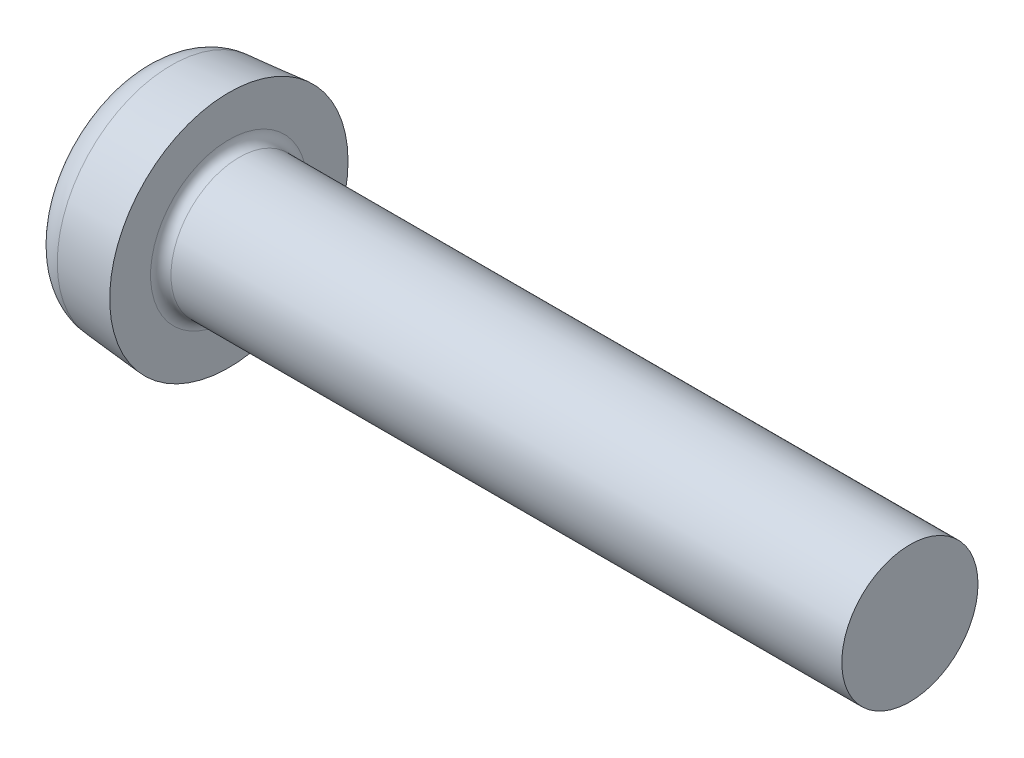
ISO-10303-21;
HEADER;
FILE_DESCRIPTION(('STEP AP214'),'2;1');
FILE_NAME('part.step','',(''),(''),'','','');
FILE_SCHEMA(('AUTOMOTIVE_DESIGN { 1 0 10303 214 1 1 1 1 }'));
ENDSEC;
DATA;
#1=APPLICATION_CONTEXT('core data for automotive mechanical design processes');
#2=APPLICATION_PROTOCOL_DEFINITION('international standard','automotive_design',2000,#1);
#3=PRODUCT_CONTEXT('',#1,'mechanical');
#4=PRODUCT('Part','Part','',(#3));
#5=PRODUCT_RELATED_PRODUCT_CATEGORY('part','',(#4));
#6=PRODUCT_DEFINITION_FORMATION('','',#4);
#7=PRODUCT_DEFINITION_CONTEXT('part definition',#1,'design');
#8=PRODUCT_DEFINITION('design','',#6,#7);
#9=PRODUCT_DEFINITION_SHAPE('','',#8);
#10=(LENGTH_UNIT() NAMED_UNIT(*) SI_UNIT(.MILLI.,.METRE.));
#11=(NAMED_UNIT(*) PLANE_ANGLE_UNIT() SI_UNIT($,.RADIAN.));
#12=(NAMED_UNIT(*) SI_UNIT($,.STERADIAN.) SOLID_ANGLE_UNIT());
#13=UNCERTAINTY_MEASURE_WITH_UNIT(LENGTH_MEASURE(1.E-05),#10,'distance_accuracy_value','');
#14=(GEOMETRIC_REPRESENTATION_CONTEXT(3) GLOBAL_UNCERTAINTY_ASSIGNED_CONTEXT((#13)) GLOBAL_UNIT_ASSIGNED_CONTEXT((#10,
#11,#12)) REPRESENTATION_CONTEXT('',''));
#15=CARTESIAN_POINT('',(0.,0.,0.));
#16=DIRECTION('',(0.,0.,1.));
#17=DIRECTION('',(1.,0.,0.));
#18=AXIS2_PLACEMENT_3D('',#15,#16,#17);
#19=CARTESIAN_POINT('',(0.,0.,0.));
#20=DIRECTION('',(-1.,0.,0.));
#21=DIRECTION('',(0.,0.,1.));
#22=AXIS2_PLACEMENT_3D('',#19,#20,#21);
#23=PLANE('',#22);
#24=CARTESIAN_POINT('',(0.,0.,0.));
#25=DIRECTION('',(-1.,0.,0.));
#26=DIRECTION('',(0.,0.,1.));
#27=AXIS2_PLACEMENT_3D('',#24,#25,#26);
#28=CIRCLE('',#27,2.35619830081517);
#29=CARTESIAN_POINT('',(0.,0.,2.35619830081517));
#30=VERTEX_POINT('',#29);
#31=EDGE_CURVE('E11',#30,#30,#28,.T.);
#32=ORIENTED_EDGE('',*,*,#31,.T.);
#33=EDGE_LOOP('',(#32));
#34=FACE_BOUND('',#33,.T.);
#35=DIRECTION('',(0.,0.,-1.));
#36=VECTOR('',#35,1.);
#37=CARTESIAN_POINT('',(0.,-0.41,0.41));
#38=LINE('',#37,#36);
#39=CARTESIAN_POINT('',(0.,-0.41,2.05));
#40=VERTEX_POINT('',#39);
#41=CARTESIAN_POINT('',(0.,-0.41,0.71));
#42=VERTEX_POINT('',#41);
#43=EDGE_CURVE('E230',#40,#42,#38,.T.);
#44=ORIENTED_EDGE('',*,*,#43,.T.);
#45=CARTESIAN_POINT('',(0.,-0.71,0.71));
#46=DIRECTION('',(-1.,0.,0.));
#47=DIRECTION('',(0.,0.,1.));
#48=AXIS2_PLACEMENT_3D('',#45,#46,#47);
#49=CIRCLE('',#48,0.3);
#50=CARTESIAN_POINT('',(0.,-0.71,0.409999999999999));
#51=VERTEX_POINT('',#50);
#52=EDGE_CURVE('E178',#42,#51,#49,.T.);
#53=ORIENTED_EDGE('',*,*,#52,.T.);
#54=DIRECTION('',(0.,-1.,0.));
#55=VECTOR('',#54,1.);
#56=CARTESIAN_POINT('',(0.,-0.41,0.41));
#57=LINE('',#56,#55);
#58=CARTESIAN_POINT('',(0.,-2.05,0.409999999999999));
#59=VERTEX_POINT('',#58);
#60=EDGE_CURVE('E227',#51,#59,#57,.T.);
#61=ORIENTED_EDGE('',*,*,#60,.T.);
#62=DIRECTION('',(0.,0.,-1.));
#63=VECTOR('',#62,1.);
#64=CARTESIAN_POINT('',(0.,-2.05,-0.41));
#65=LINE('',#64,#63);
#66=CARTESIAN_POINT('',(0.,-2.05,-0.41));
#67=VERTEX_POINT('',#66);
#68=EDGE_CURVE('E109',#59,#67,#65,.T.);
#69=ORIENTED_EDGE('',*,*,#68,.T.);
#70=DIRECTION('',(0.,1.,0.));
#71=VECTOR('',#70,1.);
#72=CARTESIAN_POINT('',(0.,-0.41,-0.41));
#73=LINE('',#72,#71);
#74=CARTESIAN_POINT('',(0.,-0.71,-0.41));
#75=VERTEX_POINT('',#74);
#76=EDGE_CURVE('E223',#67,#75,#73,.T.);
#77=ORIENTED_EDGE('',*,*,#76,.T.);
#78=CARTESIAN_POINT('',(0.,-0.71,-0.71));
#79=DIRECTION('',(-1.,0.,0.));
#80=DIRECTION('',(0.,0.,1.));
#81=AXIS2_PLACEMENT_3D('',#78,#79,#80);
#82=CIRCLE('',#81,0.3);
#83=CARTESIAN_POINT('',(0.,-0.41,-0.71));
#84=VERTEX_POINT('',#83);
#85=EDGE_CURVE('E181',#75,#84,#82,.T.);
#86=ORIENTED_EDGE('',*,*,#85,.T.);
#87=DIRECTION('',(0.,0.,-1.));
#88=VECTOR('',#87,1.);
#89=CARTESIAN_POINT('',(0.,-0.41,-0.41));
#90=LINE('',#89,#88);
#91=CARTESIAN_POINT('',(0.,-0.41,-2.05));
#92=VERTEX_POINT('',#91);
#93=EDGE_CURVE('E220',#84,#92,#90,.T.);
#94=ORIENTED_EDGE('',*,*,#93,.T.);
#95=DIRECTION('',(0.,1.,0.));
#96=VECTOR('',#95,1.);
#97=CARTESIAN_POINT('',(0.,0.41,-2.05));
#98=LINE('',#97,#96);
#99=CARTESIAN_POINT('',(0.,0.41,-2.05));
#100=VERTEX_POINT('',#99);
#101=EDGE_CURVE('E217',#92,#100,#98,.T.);
#102=ORIENTED_EDGE('',*,*,#101,.T.);
#103=DIRECTION('',(0.,0.,1.));
#104=VECTOR('',#103,1.);
#105=CARTESIAN_POINT('',(0.,0.41,-0.41));
#106=LINE('',#105,#104);
#107=CARTESIAN_POINT('',(0.,0.41,-0.71));
#108=VERTEX_POINT('',#107);
#109=EDGE_CURVE('E214',#100,#108,#106,.T.);
#110=ORIENTED_EDGE('',*,*,#109,.T.);
#111=CARTESIAN_POINT('',(0.,0.71,-0.71));
#112=DIRECTION('',(-1.,0.,0.));
#113=DIRECTION('',(0.,0.,1.));
#114=AXIS2_PLACEMENT_3D('',#111,#112,#113);
#115=CIRCLE('',#114,0.3);
#116=CARTESIAN_POINT('',(0.,0.71,-0.41));
#117=VERTEX_POINT('',#116);
#118=EDGE_CURVE('E187',#108,#117,#115,.T.);
#119=ORIENTED_EDGE('',*,*,#118,.T.);
#120=DIRECTION('',(0.,1.,0.));
#121=VECTOR('',#120,1.);
#122=CARTESIAN_POINT('',(0.,0.41,-0.41));
#123=LINE('',#122,#121);
#124=CARTESIAN_POINT('',(0.,2.05,-0.41));
#125=VERTEX_POINT('',#124);
#126=EDGE_CURVE('E211',#117,#125,#123,.T.);
#127=ORIENTED_EDGE('',*,*,#126,.T.);
#128=DIRECTION('',(0.,0.,1.));
#129=VECTOR('',#128,1.);
#130=CARTESIAN_POINT('',(0.,2.05,-0.41));
#131=LINE('',#130,#129);
#132=CARTESIAN_POINT('',(0.,2.05,0.41));
#133=VERTEX_POINT('',#132);
#134=EDGE_CURVE('E208',#125,#133,#131,.T.);
#135=ORIENTED_EDGE('',*,*,#134,.T.);
#136=DIRECTION('',(0.,-1.,0.));
#137=VECTOR('',#136,1.);
#138=CARTESIAN_POINT('',(0.,0.41,0.41));
#139=LINE('',#138,#137);
#140=CARTESIAN_POINT('',(0.,0.71,0.41));
#141=VERTEX_POINT('',#140);
#142=EDGE_CURVE('E205',#133,#141,#139,.T.);
#143=ORIENTED_EDGE('',*,*,#142,.T.);
#144=CARTESIAN_POINT('',(0.,0.71,0.71));
#145=DIRECTION('',(-1.,0.,0.));
#146=DIRECTION('',(0.,0.,1.));
#147=AXIS2_PLACEMENT_3D('',#144,#145,#146);
#148=CIRCLE('',#147,0.3);
#149=CARTESIAN_POINT('',(0.,0.41,0.71));
#150=VERTEX_POINT('',#149);
#151=EDGE_CURVE('E184',#141,#150,#148,.T.);
#152=ORIENTED_EDGE('',*,*,#151,.T.);
#153=DIRECTION('',(0.,0.,1.));
#154=VECTOR('',#153,1.);
#155=CARTESIAN_POINT('',(0.,0.41,0.41));
#156=LINE('',#155,#154);
#157=CARTESIAN_POINT('',(0.,0.409999999999999,2.05));
#158=VERTEX_POINT('',#157);
#159=EDGE_CURVE('E236',#150,#158,#156,.T.);
#160=ORIENTED_EDGE('',*,*,#159,.T.);
#161=DIRECTION('',(0.,-1.,0.));
#162=VECTOR('',#161,1.);
#163=CARTESIAN_POINT('',(0.,0.409999999999999,2.05));
#164=LINE('',#163,#162);
#165=EDGE_CURVE('E233',#158,#40,#164,.T.);
#166=ORIENTED_EDGE('',*,*,#165,.T.);
#167=EDGE_LOOP('',(#44,#53,#61,#69,#77,#86,#94,#102,#110,#119,#127,#135,#143,#152,#160,#166));
#168=FACE_BOUND('',#167,.T.);
#169=ADVANCED_FACE('F37',(#34,#168),#23,.T.);
#170=CARTESIAN_POINT('',(22.6,2.,0.));
#171=DIRECTION('',(1.,0.,0.));
#172=DIRECTION('',(0.,0.,-1.));
#173=AXIS2_PLACEMENT_3D('',#170,#171,#172);
#174=PLANE('',#173);
#175=CARTESIAN_POINT('',(22.6,0.,0.));
#176=DIRECTION('',(1.,0.,0.));
#177=DIRECTION('',(0.,0.,-1.));
#178=AXIS2_PLACEMENT_3D('',#175,#176,#177);
#179=CIRCLE('',#178,2.);
#180=CARTESIAN_POINT('',(22.6,0.,-2.));
#181=VERTEX_POINT('',#180);
#182=EDGE_CURVE('E193',#181,#181,#179,.T.);
#183=ORIENTED_EDGE('',*,*,#182,.T.);
#184=EDGE_LOOP('',(#183));
#185=FACE_BOUND('',#184,.T.);
#186=ADVANCED_FACE('F355',(#185),#174,.T.);
#187=CARTESIAN_POINT('',(4.51581291088132,0.,0.));
#188=DIRECTION('',(1.,0.,0.));
#189=DIRECTION('',(0.,0.,-1.));
#190=AXIS2_PLACEMENT_3D('',#187,#188,#189);
#191=CYLINDRICAL_SURFACE('',#190,2.);
#192=CARTESIAN_POINT('',(2.9,0.,0.));
#193=DIRECTION('',(1.,0.,0.));
#194=DIRECTION('',(0.,0.,-1.));
#195=AXIS2_PLACEMENT_3D('',#192,#193,#194);
#196=CIRCLE('',#195,2.);
#197=CARTESIAN_POINT('',(2.9,0.,-2.));
#198=VERTEX_POINT('',#197);
#199=EDGE_CURVE('E196',#198,#198,#196,.T.);
#200=ORIENTED_EDGE('',*,*,#199,.T.);
#201=EDGE_LOOP('',(#200));
#202=FACE_BOUND('',#201,.T.);
#203=ORIENTED_EDGE('',*,*,#182,.F.);
#204=EDGE_LOOP('',(#203));
#205=FACE_BOUND('',#204,.T.);
#206=ADVANCED_FACE('F361',(#202,#205),#191,.T.);
#207=CARTESIAN_POINT('',(2.9,0.,0.));
#208=DIRECTION('',(1.,0.,0.));
#209=DIRECTION('',(0.,0.,-1.));
#210=AXIS2_PLACEMENT_3D('',#207,#208,#209);
#211=TOROIDAL_SURFACE('',#210,2.3,0.3);
#212=CARTESIAN_POINT('',(2.6,0.,0.));
#213=DIRECTION('',(1.,0.,0.));
#214=DIRECTION('',(0.,0.,-1.));
#215=AXIS2_PLACEMENT_3D('',#212,#213,#214);
#216=CIRCLE('',#215,2.3);
#217=CARTESIAN_POINT('',(2.6,0.,-2.3));
#218=VERTEX_POINT('',#217);
#219=EDGE_CURVE('E199',#218,#218,#216,.T.);
#220=ORIENTED_EDGE('',*,*,#219,.T.);
#221=EDGE_LOOP('',(#220));
#222=FACE_BOUND('',#221,.T.);
#223=ORIENTED_EDGE('',*,*,#199,.F.);
#224=EDGE_LOOP('',(#223));
#225=FACE_BOUND('',#224,.T.);
#226=ADVANCED_FACE('F372',(#222,#225),#211,.F.);
#227=CARTESIAN_POINT('',(2.6,2.3,0.));
#228=DIRECTION('',(1.,0.,0.));
#229=DIRECTION('',(0.,0.,-1.));
#230=AXIS2_PLACEMENT_3D('',#227,#228,#229);
#231=PLANE('',#230);
#232=CARTESIAN_POINT('',(2.6,0.,0.));
#233=DIRECTION('',(1.,0.,0.));
#234=DIRECTION('',(0.,0.,-1.));
#235=AXIS2_PLACEMENT_3D('',#232,#233,#234);
#236=CIRCLE('',#235,3.5);
#237=CARTESIAN_POINT('',(2.6,0.,-3.5));
#238=VERTEX_POINT('',#237);
#239=EDGE_CURVE('E144',#238,#238,#236,.T.);
#240=ORIENTED_EDGE('',*,*,#239,.T.);
#241=EDGE_LOOP('',(#240));
#242=FACE_BOUND('',#241,.T.);
#243=ORIENTED_EDGE('',*,*,#219,.F.);
#244=EDGE_LOOP('',(#243));
#245=FACE_BOUND('',#244,.T.);
#246=ADVANCED_FACE('F368',(#242,#245),#231,.T.);
#247=CARTESIAN_POINT('',(2.6,0.,0.));
#248=DIRECTION('',(1.,0.,0.));
#249=DIRECTION('',(0.,0.,-1.));
#250=AXIS2_PLACEMENT_3D('',#247,#248,#249);
#251=CONICAL_SURFACE('',#250,3.5,0.08726646259972);
#252=CARTESIAN_POINT('',(0.91284425725234,0.,0.));
#253=DIRECTION('',(-1.,0.,0.));
#254=DIRECTION('',(0.,0.,1.));
#255=AXIS2_PLACEMENT_3D('',#252,#253,#254);
#256=CIRCLE('',#255,3.35239299890691);
#257=CARTESIAN_POINT('',(0.91284425725234,0.,3.35239299890691));
#258=VERTEX_POINT('',#257);
#259=EDGE_CURVE('E47',#258,#258,#256,.F.);
#260=ORIENTED_EDGE('',*,*,#259,.T.);
#261=EDGE_LOOP('',(#260));
#262=FACE_BOUND('',#261,.T.);
#263=ORIENTED_EDGE('',*,*,#239,.F.);
#264=EDGE_LOOP('',(#263));
#265=FACE_BOUND('',#264,.T.);
#266=ADVANCED_FACE('F365',(#262,#265),#251,.T.);
#267=CARTESIAN_POINT('',(2.6,0.41,0.41));
#268=DIRECTION('',(0.,-1.,0.));
#269=DIRECTION('',(0.,0.,-1.));
#270=AXIS2_PLACEMENT_3D('',#267,#268,#269);
#271=PLANE('',#270);
#272=ORIENTED_EDGE('',*,*,#159,.F.);
#273=DIRECTION('',(-1.,0.,0.));
#274=VECTOR('',#273,1.);
#275=CARTESIAN_POINT('',(2.6,0.41,0.71));
#276=LINE('',#275,#274);
#277=CARTESIAN_POINT('',(2.6,0.41,0.71));
#278=VERTEX_POINT('',#277);
#279=EDGE_CURVE('E165',#150,#278,#276,.F.);
#280=ORIENTED_EDGE('',*,*,#279,.T.);
#281=DIRECTION('',(0.,0.,1.));
#282=VECTOR('',#281,1.);
#283=CARTESIAN_POINT('',(2.6,0.41,0.41));
#284=LINE('',#283,#282);
#285=CARTESIAN_POINT('',(2.6,0.41,1.10367739090787));
#286=VERTEX_POINT('',#285);
#287=EDGE_CURVE('E147',#278,#286,#284,.T.);
#288=ORIENTED_EDGE('',*,*,#287,.T.);
#289=DIRECTION('',(-0.939692620785908,0.,0.342020143325669));
#290=VECTOR('',#289,1.);
#291=CARTESIAN_POINT('',(0.,0.409999999999999,2.05));
#292=LINE('',#291,#290);
#293=EDGE_CURVE('E141',#286,#158,#292,.T.);
#294=ORIENTED_EDGE('',*,*,#293,.T.);
#295=EDGE_LOOP('',(#272,#280,#288,#294));
#296=FACE_BOUND('',#295,.T.);
#297=ADVANCED_FACE('F250',(#296),#271,.T.);
#298=CARTESIAN_POINT('',(0.,0.409999999999999,2.05));
#299=DIRECTION('',(-0.342020143325669,0.,-0.939692620785908));
#300=DIRECTION('',(-0.939692620785908,0.,0.342020143325669));
#301=AXIS2_PLACEMENT_3D('',#298,#299,#300);
#302=PLANE('',#301);
#303=ORIENTED_EDGE('',*,*,#165,.F.);
#304=ORIENTED_EDGE('',*,*,#293,.F.);
#305=DIRECTION('',(0.,-1.,0.));
#306=VECTOR('',#305,1.);
#307=CARTESIAN_POINT('',(2.6,0.41,1.10367739090787));
#308=LINE('',#307,#306);
#309=CARTESIAN_POINT('',(2.6,-0.41,1.10367739090787));
#310=VERTEX_POINT('',#309);
#311=EDGE_CURVE('E145',#286,#310,#308,.T.);
#312=ORIENTED_EDGE('',*,*,#311,.T.);
#313=DIRECTION('',(-0.939692620785908,0.,0.342020143325669));
#314=VECTOR('',#313,1.);
#315=CARTESIAN_POINT('',(2.82294361599763,-0.41,1.02253255076506));
#316=LINE('',#315,#314);
#317=EDGE_CURVE('E110',#310,#40,#316,.T.);
#318=ORIENTED_EDGE('',*,*,#317,.T.);
#319=EDGE_LOOP('',(#303,#304,#312,#318));
#320=FACE_BOUND('',#319,.T.);
#321=ADVANCED_FACE('F259',(#320),#302,.T.);
#322=CARTESIAN_POINT('',(2.6,-0.41,0.41));
#323=DIRECTION('',(0.,1.,0.));
#324=DIRECTION('',(0.,0.,1.));
#325=AXIS2_PLACEMENT_3D('',#322,#323,#324);
#326=PLANE('',#325);
#327=DIRECTION('',(0.,0.,-1.));
#328=VECTOR('',#327,1.);
#329=CARTESIAN_POINT('',(2.6,-0.41,0.41));
#330=LINE('',#329,#328);
#331=CARTESIAN_POINT('',(2.6,-0.41,0.71));
#332=VERTEX_POINT('',#331);
#333=EDGE_CURVE('E105',#310,#332,#330,.T.);
#334=ORIENTED_EDGE('',*,*,#333,.T.);
#335=DIRECTION('',(-1.,0.,0.));
#336=VECTOR('',#335,1.);
#337=CARTESIAN_POINT('',(2.6,-0.41,0.71));
#338=LINE('',#337,#336);
#339=EDGE_CURVE('E190',#332,#42,#338,.T.);
#340=ORIENTED_EDGE('',*,*,#339,.T.);
#341=ORIENTED_EDGE('',*,*,#43,.F.);
#342=ORIENTED_EDGE('',*,*,#317,.F.);
#343=EDGE_LOOP('',(#334,#340,#341,#342));
#344=FACE_BOUND('',#343,.T.);
#345=ADVANCED_FACE('F344',(#344),#326,.T.);
#346=CARTESIAN_POINT('',(2.6,-0.41,0.41));
#347=DIRECTION('',(0.,0.,-1.));
#348=DIRECTION('',(0.,1.,0.));
#349=AXIS2_PLACEMENT_3D('',#346,#347,#348);
#350=PLANE('',#349);
#351=ORIENTED_EDGE('',*,*,#60,.F.);
#352=DIRECTION('',(-1.,0.,0.));
#353=VECTOR('',#352,1.);
#354=CARTESIAN_POINT('',(2.6,-0.71,0.409999999999999));
#355=LINE('',#354,#353);
#356=CARTESIAN_POINT('',(2.6,-0.71,0.409999999999999));
#357=VERTEX_POINT('',#356);
#358=EDGE_CURVE('E101',#51,#357,#355,.F.);
#359=ORIENTED_EDGE('',*,*,#358,.T.);
#360=DIRECTION('',(0.,-1.,0.));
#361=VECTOR('',#360,1.);
#362=CARTESIAN_POINT('',(2.6,-0.41,0.41));
#363=LINE('',#362,#361);
#364=CARTESIAN_POINT('',(2.6,-1.10367739090787,0.409999999999999));
#365=VERTEX_POINT('',#364);
#366=EDGE_CURVE('E94',#357,#365,#363,.T.);
#367=ORIENTED_EDGE('',*,*,#366,.T.);
#368=DIRECTION('',(-0.939692620785908,-0.342020143325669,0.));
#369=VECTOR('',#368,1.);
#370=CARTESIAN_POINT('',(0.,-2.05,0.409999999999999));
#371=LINE('',#370,#369);
#372=EDGE_CURVE('E41',#365,#59,#371,.T.);
#373=ORIENTED_EDGE('',*,*,#372,.T.);
#374=EDGE_LOOP('',(#351,#359,#367,#373));
#375=FACE_BOUND('',#374,.T.);
#376=ADVANCED_FACE('F96',(#375),#350,.T.);
#377=CARTESIAN_POINT('',(0.,-2.05,-0.41));
#378=DIRECTION('',(-0.342020143325669,0.939692620785908,0.));
#379=DIRECTION('',(-0.939692620785908,-0.342020143325669,0.));
#380=AXIS2_PLACEMENT_3D('',#377,#378,#379);
#381=PLANE('',#380);
#382=ORIENTED_EDGE('',*,*,#68,.F.);
#383=ORIENTED_EDGE('',*,*,#372,.F.);
#384=DIRECTION('',(0.,0.,-1.));
#385=VECTOR('',#384,1.);
#386=CARTESIAN_POINT('',(2.6,-1.10367739090787,-0.41));
#387=LINE('',#386,#385);
#388=CARTESIAN_POINT('',(2.6,-1.10367739090787,-0.41));
#389=VERTEX_POINT('',#388);
#390=EDGE_CURVE('E87',#365,#389,#387,.T.);
#391=ORIENTED_EDGE('',*,*,#390,.T.);
#392=DIRECTION('',(-0.939692620785908,-0.342020143325669,0.));
#393=VECTOR('',#392,1.);
#394=CARTESIAN_POINT('',(2.82294361599763,-1.02253255076506,-0.41));
#395=LINE('',#394,#393);
#396=EDGE_CURVE('E111',#389,#67,#395,.T.);
#397=ORIENTED_EDGE('',*,*,#396,.T.);
#398=EDGE_LOOP('',(#382,#383,#391,#397));
#399=FACE_BOUND('',#398,.T.);
#400=ADVANCED_FACE('F107',(#399),#381,.T.);
#401=CARTESIAN_POINT('',(2.6,-0.41,-0.41));
#402=DIRECTION('',(0.,0.,1.));
#403=DIRECTION('',(1.,0.,0.));
#404=AXIS2_PLACEMENT_3D('',#401,#402,#403);
#405=PLANE('',#404);
#406=DIRECTION('',(0.,1.,0.));
#407=VECTOR('',#406,1.);
#408=CARTESIAN_POINT('',(2.6,-0.41,-0.41));
#409=LINE('',#408,#407);
#410=CARTESIAN_POINT('',(2.6,-0.71,-0.41));
#411=VERTEX_POINT('',#410);
#412=EDGE_CURVE('E117',#389,#411,#409,.T.);
#413=ORIENTED_EDGE('',*,*,#412,.T.);
#414=DIRECTION('',(-1.,0.,0.));
#415=VECTOR('',#414,1.);
#416=CARTESIAN_POINT('',(2.6,-0.71,-0.41));
#417=LINE('',#416,#415);
#418=EDGE_CURVE('E174',#411,#75,#417,.T.);
#419=ORIENTED_EDGE('',*,*,#418,.T.);
#420=ORIENTED_EDGE('',*,*,#76,.F.);
#421=ORIENTED_EDGE('',*,*,#396,.F.);
#422=EDGE_LOOP('',(#413,#419,#420,#421));
#423=FACE_BOUND('',#422,.T.);
#424=ADVANCED_FACE('F339',(#423),#405,.T.);
#425=CARTESIAN_POINT('',(2.6,-0.41,-0.41));
#426=DIRECTION('',(0.,1.,0.));
#427=DIRECTION('',(0.,0.,1.));
#428=AXIS2_PLACEMENT_3D('',#425,#426,#427);
#429=PLANE('',#428);
#430=ORIENTED_EDGE('',*,*,#93,.F.);
#431=DIRECTION('',(-1.,0.,0.));
#432=VECTOR('',#431,1.);
#433=CARTESIAN_POINT('',(2.6,-0.41,-0.71));
#434=LINE('',#433,#432);
#435=CARTESIAN_POINT('',(2.6,-0.41,-0.71));
#436=VERTEX_POINT('',#435);
#437=EDGE_CURVE('E171',#84,#436,#434,.F.);
#438=ORIENTED_EDGE('',*,*,#437,.T.);
#439=DIRECTION('',(0.,0.,-1.));
#440=VECTOR('',#439,1.);
#441=CARTESIAN_POINT('',(2.6,-0.41,-0.41));
#442=LINE('',#441,#440);
#443=CARTESIAN_POINT('',(2.6,-0.41,-1.10367739090787));
#444=VERTEX_POINT('',#443);
#445=EDGE_CURVE('E118',#436,#444,#442,.T.);
#446=ORIENTED_EDGE('',*,*,#445,.T.);
#447=DIRECTION('',(-0.939692620785908,0.,-0.342020143325669));
#448=VECTOR('',#447,1.);
#449=CARTESIAN_POINT('',(0.,-0.41,-2.05));
#450=LINE('',#449,#448);
#451=EDGE_CURVE('E122',#444,#92,#450,.T.);
#452=ORIENTED_EDGE('',*,*,#451,.T.);
#453=EDGE_LOOP('',(#430,#438,#446,#452));
#454=FACE_BOUND('',#453,.T.);
#455=ADVANCED_FACE('F394',(#454),#429,.T.);
#456=CARTESIAN_POINT('',(0.,0.41,-2.05));
#457=DIRECTION('',(-0.342020143325669,0.,0.939692620785908));
#458=DIRECTION('',(0.939692620785908,0.,0.342020143325669));
#459=AXIS2_PLACEMENT_3D('',#456,#457,#458);
#460=PLANE('',#459);
#461=ORIENTED_EDGE('',*,*,#101,.F.);
#462=ORIENTED_EDGE('',*,*,#451,.F.);
#463=DIRECTION('',(0.,1.,0.));
#464=VECTOR('',#463,1.);
#465=CARTESIAN_POINT('',(2.6,0.41,-1.10367739090787));
#466=LINE('',#465,#464);
#467=CARTESIAN_POINT('',(2.6,0.41,-1.10367739090787));
#468=VERTEX_POINT('',#467);
#469=EDGE_CURVE('E126',#444,#468,#466,.T.);
#470=ORIENTED_EDGE('',*,*,#469,.T.);
#471=DIRECTION('',(-0.939692620785908,0.,-0.342020143325669));
#472=VECTOR('',#471,1.);
#473=CARTESIAN_POINT('',(2.82294361599763,0.41,-1.02253255076506));
#474=LINE('',#473,#472);
#475=EDGE_CURVE('E125',#468,#100,#474,.T.);
#476=ORIENTED_EDGE('',*,*,#475,.T.);
#477=EDGE_LOOP('',(#461,#462,#470,#476));
#478=FACE_BOUND('',#477,.T.);
#479=ADVANCED_FACE('F328',(#478),#460,.T.);
#480=CARTESIAN_POINT('',(2.6,0.41,-0.41));
#481=DIRECTION('',(0.,-1.,0.));
#482=DIRECTION('',(0.,0.,-1.));
#483=AXIS2_PLACEMENT_3D('',#480,#481,#482);
#484=PLANE('',#483);
#485=DIRECTION('',(0.,0.,1.));
#486=VECTOR('',#485,1.);
#487=CARTESIAN_POINT('',(2.6,0.41,-0.41));
#488=LINE('',#487,#486);
#489=CARTESIAN_POINT('',(2.6,0.41,-0.71));
#490=VERTEX_POINT('',#489);
#491=EDGE_CURVE('E128',#468,#490,#488,.T.);
#492=ORIENTED_EDGE('',*,*,#491,.T.);
#493=DIRECTION('',(-1.,0.,0.));
#494=VECTOR('',#493,1.);
#495=CARTESIAN_POINT('',(2.6,0.41,-0.71));
#496=LINE('',#495,#494);
#497=EDGE_CURVE('E162',#490,#108,#496,.T.);
#498=ORIENTED_EDGE('',*,*,#497,.T.);
#499=ORIENTED_EDGE('',*,*,#109,.F.);
#500=ORIENTED_EDGE('',*,*,#475,.F.);
#501=EDGE_LOOP('',(#492,#498,#499,#500));
#502=FACE_BOUND('',#501,.T.);
#503=ADVANCED_FACE('F322',(#502),#484,.T.);
#504=CARTESIAN_POINT('',(2.6,0.41,-0.41));
#505=DIRECTION('',(0.,0.,1.));
#506=DIRECTION('',(1.,0.,0.));
#507=AXIS2_PLACEMENT_3D('',#504,#505,#506);
#508=PLANE('',#507);
#509=ORIENTED_EDGE('',*,*,#126,.F.);
#510=DIRECTION('',(-1.,0.,0.));
#511=VECTOR('',#510,1.);
#512=CARTESIAN_POINT('',(2.6,0.71,-0.41));
#513=LINE('',#512,#511);
#514=CARTESIAN_POINT('',(2.6,0.71,-0.41));
#515=VERTEX_POINT('',#514);
#516=EDGE_CURVE('E56',#117,#515,#513,.F.);
#517=ORIENTED_EDGE('',*,*,#516,.T.);
#518=DIRECTION('',(0.,1.,0.));
#519=VECTOR('',#518,1.);
#520=CARTESIAN_POINT('',(2.6,0.41,-0.41));
#521=LINE('',#520,#519);
#522=CARTESIAN_POINT('',(2.6,1.10367739090787,-0.41));
#523=VERTEX_POINT('',#522);
#524=EDGE_CURVE('E138',#515,#523,#521,.T.);
#525=ORIENTED_EDGE('',*,*,#524,.T.);
#526=DIRECTION('',(-0.939692620785908,0.342020143325669,0.));
#527=VECTOR('',#526,1.);
#528=CARTESIAN_POINT('',(0.,2.05,-0.41));
#529=LINE('',#528,#527);
#530=EDGE_CURVE('E131',#523,#125,#529,.T.);
#531=ORIENTED_EDGE('',*,*,#530,.T.);
#532=EDGE_LOOP('',(#509,#517,#525,#531));
#533=FACE_BOUND('',#532,.T.);
#534=ADVANCED_FACE('F399',(#533),#508,.T.);
#535=CARTESIAN_POINT('',(0.,2.05,-0.41));
#536=DIRECTION('',(-0.342020143325669,-0.939692620785908,0.));
#537=DIRECTION('',(0.939692620785908,-0.342020143325669,0.));
#538=AXIS2_PLACEMENT_3D('',#535,#536,#537);
#539=PLANE('',#538);
#540=ORIENTED_EDGE('',*,*,#134,.F.);
#541=ORIENTED_EDGE('',*,*,#530,.F.);
#542=DIRECTION('',(0.,0.,1.));
#543=VECTOR('',#542,1.);
#544=CARTESIAN_POINT('',(2.6,1.10367739090787,-0.41));
#545=LINE('',#544,#543);
#546=CARTESIAN_POINT('',(2.6,1.10367739090787,0.41));
#547=VERTEX_POINT('',#546);
#548=EDGE_CURVE('E135',#523,#547,#545,.T.);
#549=ORIENTED_EDGE('',*,*,#548,.T.);
#550=DIRECTION('',(-0.939692620785908,0.342020143325669,0.));
#551=VECTOR('',#550,1.);
#552=CARTESIAN_POINT('',(2.82294361599763,1.02253255076506,0.41));
#553=LINE('',#552,#551);
#554=EDGE_CURVE('E134',#547,#133,#553,.T.);
#555=ORIENTED_EDGE('',*,*,#554,.T.);
#556=EDGE_LOOP('',(#540,#541,#549,#555));
#557=FACE_BOUND('',#556,.T.);
#558=ADVANCED_FACE('F39',(#557),#539,.T.);
#559=CARTESIAN_POINT('',(2.6,0.41,0.41));
#560=DIRECTION('',(0.,0.,-1.));
#561=DIRECTION('',(0.,1.,0.));
#562=AXIS2_PLACEMENT_3D('',#559,#560,#561);
#563=PLANE('',#562);
#564=DIRECTION('',(0.,-1.,0.));
#565=VECTOR('',#564,1.);
#566=CARTESIAN_POINT('',(2.6,0.41,0.41));
#567=LINE('',#566,#565);
#568=CARTESIAN_POINT('',(2.6,0.71,0.41));
#569=VERTEX_POINT('',#568);
#570=EDGE_CURVE('E137',#547,#569,#567,.T.);
#571=ORIENTED_EDGE('',*,*,#570,.T.);
#572=DIRECTION('',(-1.,0.,0.));
#573=VECTOR('',#572,1.);
#574=CARTESIAN_POINT('',(2.6,0.71,0.41));
#575=LINE('',#574,#573);
#576=EDGE_CURVE('E168',#569,#141,#575,.T.);
#577=ORIENTED_EDGE('',*,*,#576,.T.);
#578=ORIENTED_EDGE('',*,*,#142,.F.);
#579=ORIENTED_EDGE('',*,*,#554,.F.);
#580=EDGE_LOOP('',(#571,#577,#578,#579));
#581=FACE_BOUND('',#580,.T.);
#582=ADVANCED_FACE('F309',(#581),#563,.T.);
#583=CARTESIAN_POINT('',(2.6,0.41,0.41));
#584=DIRECTION('',(1.,0.,0.));
#585=DIRECTION('',(0.,0.,-1.));
#586=AXIS2_PLACEMENT_3D('',#583,#584,#585);
#587=PLANE('',#586);
#588=ORIENTED_EDGE('',*,*,#287,.F.);
#589=CARTESIAN_POINT('',(2.6,0.71,0.71));
#590=DIRECTION('',(1.,0.,0.));
#591=DIRECTION('',(0.,0.,-1.));
#592=AXIS2_PLACEMENT_3D('',#589,#590,#591);
#593=CIRCLE('',#592,0.3);
#594=EDGE_CURVE('E154',#278,#569,#593,.T.);
#595=ORIENTED_EDGE('',*,*,#594,.T.);
#596=ORIENTED_EDGE('',*,*,#570,.F.);
#597=ORIENTED_EDGE('',*,*,#548,.F.);
#598=ORIENTED_EDGE('',*,*,#524,.F.);
#599=CARTESIAN_POINT('',(2.6,0.71,-0.71));
#600=DIRECTION('',(1.,0.,0.));
#601=DIRECTION('',(0.,0.,-1.));
#602=AXIS2_PLACEMENT_3D('',#599,#600,#601);
#603=CIRCLE('',#602,0.3);
#604=EDGE_CURVE('E152',#515,#490,#603,.T.);
#605=ORIENTED_EDGE('',*,*,#604,.T.);
#606=ORIENTED_EDGE('',*,*,#491,.F.);
#607=ORIENTED_EDGE('',*,*,#469,.F.);
#608=ORIENTED_EDGE('',*,*,#445,.F.);
#609=CARTESIAN_POINT('',(2.6,-0.71,-0.71));
#610=DIRECTION('',(1.,0.,0.));
#611=DIRECTION('',(0.,0.,-1.));
#612=AXIS2_PLACEMENT_3D('',#609,#610,#611);
#613=CIRCLE('',#612,0.3);
#614=EDGE_CURVE('E157',#436,#411,#613,.T.);
#615=ORIENTED_EDGE('',*,*,#614,.T.);
#616=ORIENTED_EDGE('',*,*,#412,.F.);
#617=ORIENTED_EDGE('',*,*,#390,.F.);
#618=ORIENTED_EDGE('',*,*,#366,.F.);
#619=CARTESIAN_POINT('',(2.6,-0.71,0.71));
#620=DIRECTION('',(1.,0.,0.));
#621=DIRECTION('',(0.,0.,-1.));
#622=AXIS2_PLACEMENT_3D('',#619,#620,#621);
#623=CIRCLE('',#622,0.3);
#624=EDGE_CURVE('E159',#357,#332,#623,.T.);
#625=ORIENTED_EDGE('',*,*,#624,.T.);
#626=ORIENTED_EDGE('',*,*,#333,.F.);
#627=ORIENTED_EDGE('',*,*,#311,.F.);
#628=EDGE_LOOP('',(#588,#595,#596,#597,#598,#605,#606,#607,#608,#615,#616,#617,#618,#625,#626,#627));
#629=FACE_BOUND('',#628,.T.);
#630=ADVANCED_FACE('F114',(#629),#587,.F.);
#631=CARTESIAN_POINT('',(2.6,-0.71,0.71));
#632=DIRECTION('',(-1.,0.,0.));
#633=DIRECTION('',(0.,0.,1.));
#634=AXIS2_PLACEMENT_3D('',#631,#632,#633);
#635=CYLINDRICAL_SURFACE('',#634,0.3);
#636=ORIENTED_EDGE('',*,*,#624,.F.);
#637=ORIENTED_EDGE('',*,*,#358,.F.);
#638=ORIENTED_EDGE('',*,*,#52,.F.);
#639=ORIENTED_EDGE('',*,*,#339,.F.);
#640=EDGE_LOOP('',(#636,#637,#638,#639));
#641=FACE_BOUND('',#640,.T.);
#642=ADVANCED_FACE('F341',(#641),#635,.T.);
#643=CARTESIAN_POINT('',(2.6,-0.71,-0.71));
#644=DIRECTION('',(-1.,0.,0.));
#645=DIRECTION('',(0.,0.,1.));
#646=AXIS2_PLACEMENT_3D('',#643,#644,#645);
#647=CYLINDRICAL_SURFACE('',#646,0.3);
#648=ORIENTED_EDGE('',*,*,#614,.F.);
#649=ORIENTED_EDGE('',*,*,#437,.F.);
#650=ORIENTED_EDGE('',*,*,#85,.F.);
#651=ORIENTED_EDGE('',*,*,#418,.F.);
#652=EDGE_LOOP('',(#648,#649,#650,#651));
#653=FACE_BOUND('',#652,.T.);
#654=ADVANCED_FACE('F336',(#653),#647,.T.);
#655=CARTESIAN_POINT('',(2.6,0.71,0.71));
#656=DIRECTION('',(-1.,0.,0.));
#657=DIRECTION('',(0.,0.,1.));
#658=AXIS2_PLACEMENT_3D('',#655,#656,#657);
#659=CYLINDRICAL_SURFACE('',#658,0.3);
#660=ORIENTED_EDGE('',*,*,#594,.F.);
#661=ORIENTED_EDGE('',*,*,#279,.F.);
#662=ORIENTED_EDGE('',*,*,#151,.F.);
#663=ORIENTED_EDGE('',*,*,#576,.F.);
#664=EDGE_LOOP('',(#660,#661,#662,#663));
#665=FACE_BOUND('',#664,.T.);
#666=ADVANCED_FACE('F311',(#665),#659,.T.);
#667=CARTESIAN_POINT('',(2.6,0.71,-0.71));
#668=DIRECTION('',(-1.,0.,0.));
#669=DIRECTION('',(0.,0.,1.));
#670=AXIS2_PLACEMENT_3D('',#667,#668,#669);
#671=CYLINDRICAL_SURFACE('',#670,0.3);
#672=ORIENTED_EDGE('',*,*,#604,.F.);
#673=ORIENTED_EDGE('',*,*,#516,.F.);
#674=ORIENTED_EDGE('',*,*,#118,.F.);
#675=ORIENTED_EDGE('',*,*,#497,.F.);
#676=EDGE_LOOP('',(#672,#673,#674,#675));
#677=FACE_BOUND('',#676,.T.);
#678=ADVANCED_FACE('F319',(#677),#671,.T.);
#679=CARTESIAN_POINT('',(1.,0.,0.));
#680=DIRECTION('',(-1.,0.,0.));
#681=DIRECTION('',(0.,0.,1.));
#682=AXIS2_PLACEMENT_3D('',#679,#680,#681);
#683=TOROIDAL_SURFACE('',#682,2.35619830081517,1.);
#684=ORIENTED_EDGE('',*,*,#31,.F.);
#685=EDGE_LOOP('',(#684));
#686=FACE_BOUND('',#685,.T.);
#687=ORIENTED_EDGE('',*,*,#259,.F.);
#688=EDGE_LOOP('',(#687));
#689=FACE_BOUND('',#688,.T.);
#690=ADVANCED_FACE('F388',(#686,#689),#683,.T.);
#691=CLOSED_SHELL('',(#169,#186,#206,#226,#246,#266,#297,#321,#345,#376,#400,#424,#455,#479,
#503,#534,#558,#582,#630,#642,#654,#666,#678,#690));
#692=MANIFOLD_SOLID_BREP('B2',#691);
#693=ADVANCED_BREP_SHAPE_REPRESENTATION('',(#18,#692),#14);
#694=SHAPE_DEFINITION_REPRESENTATION(#9,#693);
ENDSEC;
END-ISO-10303-21;
